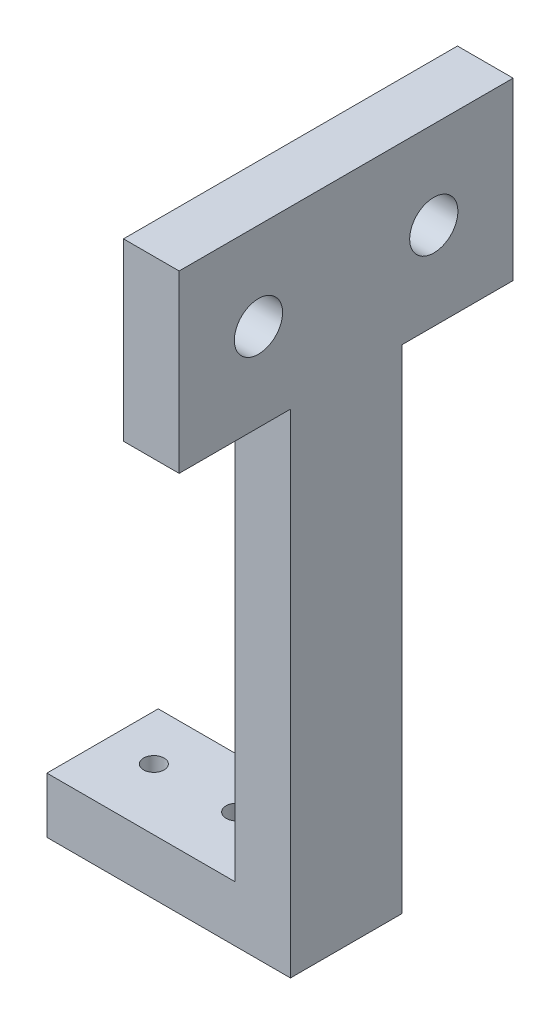
ISO-10303-21;
HEADER;
FILE_DESCRIPTION(('STEP AP214'),'2;1');
FILE_NAME('part.step','',(''),(''),'','','');
FILE_SCHEMA(('AUTOMOTIVE_DESIGN { 1 0 10303 214 1 1 1 1 }'));
ENDSEC;
DATA;
#1=APPLICATION_CONTEXT('core data for automotive mechanical design processes');
#2=APPLICATION_PROTOCOL_DEFINITION('international standard','automotive_design',2000,#1);
#3=PRODUCT_CONTEXT('',#1,'mechanical');
#4=PRODUCT('Part','Part','',(#3));
#5=PRODUCT_RELATED_PRODUCT_CATEGORY('part','',(#4));
#6=PRODUCT_DEFINITION_FORMATION('','',#4);
#7=PRODUCT_DEFINITION_CONTEXT('part definition',#1,'design');
#8=PRODUCT_DEFINITION('design','',#6,#7);
#9=PRODUCT_DEFINITION_SHAPE('','',#8);
#10=(LENGTH_UNIT() NAMED_UNIT(*) SI_UNIT(.MILLI.,.METRE.));
#11=(NAMED_UNIT(*) PLANE_ANGLE_UNIT() SI_UNIT($,.RADIAN.));
#12=(NAMED_UNIT(*) SI_UNIT($,.STERADIAN.) SOLID_ANGLE_UNIT());
#13=UNCERTAINTY_MEASURE_WITH_UNIT(LENGTH_MEASURE(1.E-05),#10,'distance_accuracy_value','');
#14=(GEOMETRIC_REPRESENTATION_CONTEXT(3) GLOBAL_UNCERTAINTY_ASSIGNED_CONTEXT((#13)) GLOBAL_UNIT_ASSIGNED_CONTEXT((#10,
#11,#12)) REPRESENTATION_CONTEXT('',''));
#15=CARTESIAN_POINT('',(0.,0.,0.));
#16=DIRECTION('',(0.,0.,1.));
#17=DIRECTION('',(1.,0.,0.));
#18=AXIS2_PLACEMENT_3D('',#15,#16,#17);
#19=CARTESIAN_POINT('',(-13.8932933364586,6.35,6.35));
#20=DIRECTION('',(1.,0.,0.));
#21=DIRECTION('',(0.,1.,0.));
#22=AXIS2_PLACEMENT_3D('',#19,#20,#21);
#23=PLANE('',#22);
#24=DIRECTION('',(0.,-1.,0.));
#25=VECTOR('',#24,1.);
#26=CARTESIAN_POINT('',(-13.8932933364586,6.35,-6.35));
#27=LINE('',#26,#25);
#28=CARTESIAN_POINT('',(-13.8932933364586,6.35,-6.35));
#29=VERTEX_POINT('',#28);
#30=CARTESIAN_POINT('',(-13.8932933364586,0.,-6.35));
#31=VERTEX_POINT('',#30);
#32=EDGE_CURVE('E153',#29,#31,#27,.T.);
#33=ORIENTED_EDGE('',*,*,#32,.T.);
#34=DIRECTION('',(0.,0.,-1.));
#35=VECTOR('',#34,1.);
#36=CARTESIAN_POINT('',(-13.8932933364586,0.,6.35));
#37=LINE('',#36,#35);
#38=CARTESIAN_POINT('',(-13.8932933364586,0.,6.35));
#39=VERTEX_POINT('',#38);
#40=EDGE_CURVE('E41',#39,#31,#37,.T.);
#41=ORIENTED_EDGE('',*,*,#40,.F.);
#42=DIRECTION('',(0.,-1.,0.));
#43=VECTOR('',#42,1.);
#44=CARTESIAN_POINT('',(-13.8932933364586,6.35,6.35));
#45=LINE('',#44,#43);
#46=CARTESIAN_POINT('',(-13.8932933364586,6.35,6.35));
#47=VERTEX_POINT('',#46);
#48=EDGE_CURVE('E154',#47,#39,#45,.T.);
#49=ORIENTED_EDGE('',*,*,#48,.F.);
#50=DIRECTION('',(0.,0.,-1.));
#51=VECTOR('',#50,1.);
#52=CARTESIAN_POINT('',(-13.8932933364586,6.35,6.35));
#53=LINE('',#52,#51);
#54=EDGE_CURVE('E165',#47,#29,#53,.T.);
#55=ORIENTED_EDGE('',*,*,#54,.T.);
#56=EDGE_LOOP('',(#33,#41,#49,#55));
#57=FACE_BOUND('',#56,.T.);
#58=ADVANCED_FACE('F34',(#57),#23,.F.);
#59=CARTESIAN_POINT('',(-13.8932933364586,0.,6.35));
#60=DIRECTION('',(0.,1.,0.));
#61=DIRECTION('',(-1.,0.,0.));
#62=AXIS2_PLACEMENT_3D('',#59,#60,#61);
#63=PLANE('',#62);
#64=CARTESIAN_POINT('',(0.806706663541388,0.,-0.649999999999986));
#65=DIRECTION('',(0.,1.,0.));
#66=DIRECTION('',(-1.,0.,0.));
#67=AXIS2_PLACEMENT_3D('',#64,#65,#66);
#68=CIRCLE('',#67,1.25);
#69=CARTESIAN_POINT('',(-0.443293336458607,0.,-0.649999999999986));
#70=VERTEX_POINT('',#69);
#71=EDGE_CURVE('E135',#70,#70,#68,.T.);
#72=ORIENTED_EDGE('',*,*,#71,.T.);
#73=EDGE_LOOP('',(#72));
#74=FACE_BOUND('',#73,.T.);
#75=CARTESIAN_POINT('',(-8.69329333645861,0.,-0.649999999999984));
#76=DIRECTION('',(0.,1.,0.));
#77=DIRECTION('',(-1.,0.,0.));
#78=AXIS2_PLACEMENT_3D('',#75,#76,#77);
#79=CIRCLE('',#78,1.175);
#80=CARTESIAN_POINT('',(-9.86829333645862,0.,-0.649999999999984));
#81=VERTEX_POINT('',#80);
#82=EDGE_CURVE('E211',#81,#81,#79,.T.);
#83=ORIENTED_EDGE('',*,*,#82,.T.);
#84=EDGE_LOOP('',(#83));
#85=FACE_BOUND('',#84,.T.);
#86=DIRECTION('',(1.,0.,0.));
#87=VECTOR('',#86,1.);
#88=CARTESIAN_POINT('',(-13.8932933364586,0.,-6.35));
#89=LINE('',#88,#87);
#90=CARTESIAN_POINT('',(13.8932933364586,0.,-6.35));
#91=VERTEX_POINT('',#90);
#92=EDGE_CURVE('E168',#31,#91,#89,.T.);
#93=ORIENTED_EDGE('',*,*,#92,.T.);
#94=DIRECTION('',(0.,0.,-1.));
#95=VECTOR('',#94,1.);
#96=CARTESIAN_POINT('',(13.8932933364586,0.,6.35));
#97=LINE('',#96,#95);
#98=CARTESIAN_POINT('',(13.8932933364586,0.,6.35));
#99=VERTEX_POINT('',#98);
#100=EDGE_CURVE('E181',#99,#91,#97,.T.);
#101=ORIENTED_EDGE('',*,*,#100,.F.);
#102=DIRECTION('',(1.,0.,0.));
#103=VECTOR('',#102,1.);
#104=CARTESIAN_POINT('',(-13.8932933364586,0.,6.35));
#105=LINE('',#104,#103);
#106=EDGE_CURVE('E157',#39,#99,#105,.T.);
#107=ORIENTED_EDGE('',*,*,#106,.F.);
#108=ORIENTED_EDGE('',*,*,#40,.T.);
#109=EDGE_LOOP('',(#93,#101,#107,#108));
#110=FACE_BOUND('',#109,.T.);
#111=ADVANCED_FACE('F186',(#74,#85,#110),#63,.F.);
#112=CARTESIAN_POINT('',(13.8932933364586,76.2,6.35));
#113=DIRECTION('',(-1.,0.,0.));
#114=DIRECTION('',(0.,-1.,0.));
#115=AXIS2_PLACEMENT_3D('',#112,#113,#114);
#116=PLANE('',#115);
#117=CARTESIAN_POINT('',(13.8932933364586,66.2,-10.));
#118=DIRECTION('',(-1.,0.,0.));
#119=DIRECTION('',(0.,-1.,0.));
#120=AXIS2_PLACEMENT_3D('',#117,#118,#119);
#121=CIRCLE('',#120,2.75);
#122=CARTESIAN_POINT('',(13.8932933364586,63.45,-10.));
#123=VERTEX_POINT('',#122);
#124=EDGE_CURVE('E212',#123,#123,#121,.T.);
#125=ORIENTED_EDGE('',*,*,#124,.T.);
#126=EDGE_LOOP('',(#125));
#127=FACE_BOUND('',#126,.T.);
#128=CARTESIAN_POINT('',(13.8932933364586,66.2,9.99999999999999));
#129=DIRECTION('',(-1.,0.,0.));
#130=DIRECTION('',(0.,-1.,0.));
#131=AXIS2_PLACEMENT_3D('',#128,#129,#130);
#132=CIRCLE('',#131,2.75);
#133=CARTESIAN_POINT('',(13.8932933364586,63.45,9.99999999999999));
#134=VERTEX_POINT('',#133);
#135=EDGE_CURVE('E220',#134,#134,#132,.T.);
#136=ORIENTED_EDGE('',*,*,#135,.T.);
#137=EDGE_LOOP('',(#136));
#138=FACE_BOUND('',#137,.T.);
#139=DIRECTION('',(0.,1.,0.));
#140=VECTOR('',#139,1.);
#141=CARTESIAN_POINT('',(13.8932933364586,76.2,-6.35));
#142=LINE('',#141,#140);
#143=CARTESIAN_POINT('',(13.8932933364586,56.2,-6.35));
#144=VERTEX_POINT('',#143);
#145=EDGE_CURVE('E170',#91,#144,#142,.T.);
#146=ORIENTED_EDGE('',*,*,#145,.T.);
#147=DIRECTION('',(0.,0.,-1.));
#148=VECTOR('',#147,1.);
#149=CARTESIAN_POINT('',(13.8932933364586,56.2,-19.05));
#150=LINE('',#149,#148);
#151=CARTESIAN_POINT('',(13.8932933364586,56.2,-19.05));
#152=VERTEX_POINT('',#151);
#153=EDGE_CURVE('E200',#144,#152,#150,.T.);
#154=ORIENTED_EDGE('',*,*,#153,.T.);
#155=DIRECTION('',(0.,1.,0.));
#156=VECTOR('',#155,1.);
#157=CARTESIAN_POINT('',(13.8932933364586,56.2,-19.05));
#158=LINE('',#157,#156);
#159=CARTESIAN_POINT('',(13.8932933364586,76.2,-19.05));
#160=VERTEX_POINT('',#159);
#161=EDGE_CURVE('E148',#152,#160,#158,.T.);
#162=ORIENTED_EDGE('',*,*,#161,.T.);
#163=DIRECTION('',(0.,0.,-1.));
#164=VECTOR('',#163,1.);
#165=CARTESIAN_POINT('',(13.8932933364586,76.2,6.35));
#166=LINE('',#165,#164);
#167=CARTESIAN_POINT('',(13.8932933364586,76.2,19.05));
#168=VERTEX_POINT('',#167);
#169=EDGE_CURVE('E118',#168,#160,#166,.T.);
#170=ORIENTED_EDGE('',*,*,#169,.F.);
#171=DIRECTION('',(0.,-1.,0.));
#172=VECTOR('',#171,1.);
#173=CARTESIAN_POINT('',(13.8932933364586,56.2,19.05));
#174=LINE('',#173,#172);
#175=CARTESIAN_POINT('',(13.8932933364586,56.2,19.05));
#176=VERTEX_POINT('',#175);
#177=EDGE_CURVE('E127',#168,#176,#174,.T.);
#178=ORIENTED_EDGE('',*,*,#177,.T.);
#179=CARTESIAN_POINT('',(13.8932933364586,56.2,6.35));
#180=VERTEX_POINT('',#179);
#181=EDGE_CURVE('E204',#176,#180,#150,.T.);
#182=ORIENTED_EDGE('',*,*,#181,.T.);
#183=DIRECTION('',(0.,1.,0.));
#184=VECTOR('',#183,1.);
#185=CARTESIAN_POINT('',(13.8932933364586,76.2,6.35));
#186=LINE('',#185,#184);
#187=EDGE_CURVE('E53',#99,#180,#186,.T.);
#188=ORIENTED_EDGE('',*,*,#187,.F.);
#189=ORIENTED_EDGE('',*,*,#100,.T.);
#190=EDGE_LOOP('',(#146,#154,#162,#170,#178,#182,#188,#189));
#191=FACE_BOUND('',#190,.T.);
#192=ADVANCED_FACE('F198',(#127,#138,#191),#116,.F.);
#193=CARTESIAN_POINT('',(13.8932933364586,76.2,6.35));
#194=DIRECTION('',(0.,-1.,0.));
#195=DIRECTION('',(0.,0.,-1.));
#196=AXIS2_PLACEMENT_3D('',#193,#194,#195);
#197=PLANE('',#196);
#198=ORIENTED_EDGE('',*,*,#169,.T.);
#199=DIRECTION('',(-1.,0.,0.));
#200=VECTOR('',#199,1.);
#201=CARTESIAN_POINT('',(56.9236314713141,76.2,-19.05));
#202=LINE('',#201,#200);
#203=CARTESIAN_POINT('',(7.5432933364586,76.2,-19.05));
#204=VERTEX_POINT('',#203);
#205=EDGE_CURVE('E113',#160,#204,#202,.T.);
#206=ORIENTED_EDGE('',*,*,#205,.T.);
#207=DIRECTION('',(0.,0.,-1.));
#208=VECTOR('',#207,1.);
#209=CARTESIAN_POINT('',(7.5432933364586,76.2,6.35));
#210=LINE('',#209,#208);
#211=CARTESIAN_POINT('',(7.5432933364586,76.2,19.05));
#212=VERTEX_POINT('',#211);
#213=EDGE_CURVE('E108',#212,#204,#210,.T.);
#214=ORIENTED_EDGE('',*,*,#213,.F.);
#215=DIRECTION('',(-1.,0.,0.));
#216=VECTOR('',#215,1.);
#217=CARTESIAN_POINT('',(56.9236314713141,76.2,19.05));
#218=LINE('',#217,#216);
#219=EDGE_CURVE('E111',#168,#212,#218,.T.);
#220=ORIENTED_EDGE('',*,*,#219,.F.);
#221=EDGE_LOOP('',(#198,#206,#214,#220));
#222=FACE_BOUND('',#221,.T.);
#223=ADVANCED_FACE('F110',(#222),#197,.F.);
#224=CARTESIAN_POINT('',(7.5432933364586,76.2,6.35));
#225=DIRECTION('',(1.,0.,0.));
#226=DIRECTION('',(0.,1.,0.));
#227=AXIS2_PLACEMENT_3D('',#224,#225,#226);
#228=PLANE('',#227);
#229=CARTESIAN_POINT('',(7.5432933364586,66.2,-10.));
#230=DIRECTION('',(-1.,0.,0.));
#231=DIRECTION('',(0.,-1.,0.));
#232=AXIS2_PLACEMENT_3D('',#229,#230,#231);
#233=CIRCLE('',#232,2.75);
#234=CARTESIAN_POINT('',(7.5432933364586,63.45,-10.));
#235=VERTEX_POINT('',#234);
#236=EDGE_CURVE('E223',#235,#235,#233,.T.);
#237=ORIENTED_EDGE('',*,*,#236,.F.);
#238=EDGE_LOOP('',(#237));
#239=FACE_BOUND('',#238,.T.);
#240=CARTESIAN_POINT('',(7.5432933364586,66.2,9.99999999999999));
#241=DIRECTION('',(-1.,0.,0.));
#242=DIRECTION('',(0.,-1.,0.));
#243=AXIS2_PLACEMENT_3D('',#240,#241,#242);
#244=CIRCLE('',#243,2.75);
#245=CARTESIAN_POINT('',(7.5432933364586,63.45,9.99999999999999));
#246=VERTEX_POINT('',#245);
#247=EDGE_CURVE('E217',#246,#246,#244,.T.);
#248=ORIENTED_EDGE('',*,*,#247,.F.);
#249=EDGE_LOOP('',(#248));
#250=FACE_BOUND('',#249,.T.);
#251=DIRECTION('',(0.,-1.,0.));
#252=VECTOR('',#251,1.);
#253=CARTESIAN_POINT('',(7.5432933364586,76.2,6.35));
#254=LINE('',#253,#252);
#255=CARTESIAN_POINT('',(7.5432933364586,56.2,6.35));
#256=VERTEX_POINT('',#255);
#257=CARTESIAN_POINT('',(7.54329333645861,6.35,6.35));
#258=VERTEX_POINT('',#257);
#259=EDGE_CURVE('E161',#256,#258,#254,.T.);
#260=ORIENTED_EDGE('',*,*,#259,.F.);
#261=DIRECTION('',(0.,0.,1.));
#262=VECTOR('',#261,1.);
#263=CARTESIAN_POINT('',(7.5432933364586,56.2,-19.05));
#264=LINE('',#263,#262);
#265=CARTESIAN_POINT('',(7.5432933364586,56.2,19.05));
#266=VERTEX_POINT('',#265);
#267=EDGE_CURVE('E132',#256,#266,#264,.T.);
#268=ORIENTED_EDGE('',*,*,#267,.T.);
#269=DIRECTION('',(0.,1.,0.));
#270=VECTOR('',#269,1.);
#271=CARTESIAN_POINT('',(7.5432933364586,56.2,19.05));
#272=LINE('',#271,#270);
#273=EDGE_CURVE('E126',#266,#212,#272,.T.);
#274=ORIENTED_EDGE('',*,*,#273,.T.);
#275=ORIENTED_EDGE('',*,*,#213,.T.);
#276=DIRECTION('',(0.,-1.,0.));
#277=VECTOR('',#276,1.);
#278=CARTESIAN_POINT('',(7.5432933364586,56.2,-19.05));
#279=LINE('',#278,#277);
#280=CARTESIAN_POINT('',(7.5432933364586,56.2,-19.05));
#281=VERTEX_POINT('',#280);
#282=EDGE_CURVE('E134',#204,#281,#279,.T.);
#283=ORIENTED_EDGE('',*,*,#282,.T.);
#284=CARTESIAN_POINT('',(7.5432933364586,56.2,-6.35));
#285=VERTEX_POINT('',#284);
#286=EDGE_CURVE('E128',#281,#285,#264,.T.);
#287=ORIENTED_EDGE('',*,*,#286,.T.);
#288=DIRECTION('',(0.,-1.,0.));
#289=VECTOR('',#288,1.);
#290=CARTESIAN_POINT('',(7.5432933364586,76.2,-6.35));
#291=LINE('',#290,#289);
#292=CARTESIAN_POINT('',(7.54329333645861,6.35,-6.35));
#293=VERTEX_POINT('',#292);
#294=EDGE_CURVE('E173',#285,#293,#291,.T.);
#295=ORIENTED_EDGE('',*,*,#294,.T.);
#296=DIRECTION('',(0.,0.,-1.));
#297=VECTOR('',#296,1.);
#298=CARTESIAN_POINT('',(7.54329333645861,6.35,6.35));
#299=LINE('',#298,#297);
#300=EDGE_CURVE('E119',#258,#293,#299,.T.);
#301=ORIENTED_EDGE('',*,*,#300,.F.);
#302=EDGE_LOOP('',(#260,#268,#274,#275,#283,#287,#295,#301));
#303=FACE_BOUND('',#302,.T.);
#304=ADVANCED_FACE('F130',(#239,#250,#303),#228,.F.);
#305=CARTESIAN_POINT('',(7.54329333645861,6.35,6.35));
#306=DIRECTION('',(0.,-1.,0.));
#307=DIRECTION('',(1.,0.,0.));
#308=AXIS2_PLACEMENT_3D('',#305,#306,#307);
#309=PLANE('',#308);
#310=CARTESIAN_POINT('',(0.806706663541387,6.35,-0.649999999999986));
#311=DIRECTION('',(0.,1.,0.));
#312=DIRECTION('',(-1.,0.,0.));
#313=AXIS2_PLACEMENT_3D('',#310,#311,#312);
#314=CIRCLE('',#313,1.25);
#315=CARTESIAN_POINT('',(-0.443293336458608,6.35,-0.649999999999986));
#316=VERTEX_POINT('',#315);
#317=EDGE_CURVE('E139',#316,#316,#314,.T.);
#318=ORIENTED_EDGE('',*,*,#317,.F.);
#319=EDGE_LOOP('',(#318));
#320=FACE_BOUND('',#319,.T.);
#321=CARTESIAN_POINT('',(-8.69329333645861,6.35,-0.649999999999984));
#322=DIRECTION('',(0.,1.,0.));
#323=DIRECTION('',(-1.,0.,0.));
#324=AXIS2_PLACEMENT_3D('',#321,#322,#323);
#325=CIRCLE('',#324,1.175);
#326=CARTESIAN_POINT('',(-9.86829333645862,6.35,-0.649999999999984));
#327=VERTEX_POINT('',#326);
#328=EDGE_CURVE('E208',#327,#327,#325,.T.);
#329=ORIENTED_EDGE('',*,*,#328,.F.);
#330=EDGE_LOOP('',(#329));
#331=FACE_BOUND('',#330,.T.);
#332=DIRECTION('',(-1.,0.,0.));
#333=VECTOR('',#332,1.);
#334=CARTESIAN_POINT('',(7.54329333645861,6.35,-6.35));
#335=LINE('',#334,#333);
#336=EDGE_CURVE('E158',#293,#29,#335,.T.);
#337=ORIENTED_EDGE('',*,*,#336,.T.);
#338=ORIENTED_EDGE('',*,*,#54,.F.);
#339=DIRECTION('',(-1.,0.,0.));
#340=VECTOR('',#339,1.);
#341=CARTESIAN_POINT('',(7.54329333645861,6.35,6.35));
#342=LINE('',#341,#340);
#343=EDGE_CURVE('E163',#258,#47,#342,.T.);
#344=ORIENTED_EDGE('',*,*,#343,.F.);
#345=ORIENTED_EDGE('',*,*,#300,.T.);
#346=EDGE_LOOP('',(#337,#338,#344,#345));
#347=FACE_BOUND('',#346,.T.);
#348=ADVANCED_FACE('F240',(#320,#331,#347),#309,.F.);
#349=CARTESIAN_POINT('',(0.,0.,6.35));
#350=DIRECTION('',(0.,0.,1.));
#351=DIRECTION('',(1.,0.,0.));
#352=AXIS2_PLACEMENT_3D('',#349,#350,#351);
#353=PLANE('',#352);
#354=DIRECTION('',(1.,0.,0.));
#355=VECTOR('',#354,1.);
#356=CARTESIAN_POINT('',(0.,56.2,6.35));
#357=LINE('',#356,#355);
#358=EDGE_CURVE('E48',#256,#180,#357,.T.);
#359=ORIENTED_EDGE('',*,*,#358,.F.);
#360=ORIENTED_EDGE('',*,*,#259,.T.);
#361=ORIENTED_EDGE('',*,*,#343,.T.);
#362=ORIENTED_EDGE('',*,*,#48,.T.);
#363=ORIENTED_EDGE('',*,*,#106,.T.);
#364=ORIENTED_EDGE('',*,*,#187,.T.);
#365=EDGE_LOOP('',(#359,#360,#361,#362,#363,#364));
#366=FACE_BOUND('',#365,.T.);
#367=ADVANCED_FACE('F270',(#366),#353,.T.);
#368=CARTESIAN_POINT('',(0.,0.,-6.35));
#369=DIRECTION('',(0.,0.,1.));
#370=DIRECTION('',(1.,0.,0.));
#371=AXIS2_PLACEMENT_3D('',#368,#369,#370);
#372=PLANE('',#371);
#373=ORIENTED_EDGE('',*,*,#294,.F.);
#374=DIRECTION('',(1.,0.,0.));
#375=VECTOR('',#374,1.);
#376=CARTESIAN_POINT('',(0.,56.2,-6.35));
#377=LINE('',#376,#375);
#378=EDGE_CURVE('E11',#285,#144,#377,.T.);
#379=ORIENTED_EDGE('',*,*,#378,.T.);
#380=ORIENTED_EDGE('',*,*,#145,.F.);
#381=ORIENTED_EDGE('',*,*,#92,.F.);
#382=ORIENTED_EDGE('',*,*,#32,.F.);
#383=ORIENTED_EDGE('',*,*,#336,.F.);
#384=EDGE_LOOP('',(#373,#379,#380,#381,#382,#383));
#385=FACE_BOUND('',#384,.T.);
#386=ADVANCED_FACE('F195',(#385),#372,.F.);
#387=CARTESIAN_POINT('',(56.9236314713141,56.2,-19.05));
#388=DIRECTION('',(0.,0.,-1.));
#389=DIRECTION('',(-1.,0.,0.));
#390=AXIS2_PLACEMENT_3D('',#387,#388,#389);
#391=PLANE('',#390);
#392=ORIENTED_EDGE('',*,*,#161,.F.);
#393=DIRECTION('',(-1.,0.,0.));
#394=VECTOR('',#393,1.);
#395=CARTESIAN_POINT('',(56.9236314713141,56.2,-19.05));
#396=LINE('',#395,#394);
#397=EDGE_CURVE('E149',#152,#281,#396,.T.);
#398=ORIENTED_EDGE('',*,*,#397,.T.);
#399=ORIENTED_EDGE('',*,*,#282,.F.);
#400=ORIENTED_EDGE('',*,*,#205,.F.);
#401=EDGE_LOOP('',(#392,#398,#399,#400));
#402=FACE_BOUND('',#401,.T.);
#403=ADVANCED_FACE('F274',(#402),#391,.T.);
#404=CARTESIAN_POINT('',(56.9236314713141,56.2,-19.05));
#405=DIRECTION('',(0.,-1.,0.));
#406=DIRECTION('',(0.,0.,-1.));
#407=AXIS2_PLACEMENT_3D('',#404,#405,#406);
#408=PLANE('',#407);
#409=ORIENTED_EDGE('',*,*,#378,.F.);
#410=ORIENTED_EDGE('',*,*,#286,.F.);
#411=ORIENTED_EDGE('',*,*,#397,.F.);
#412=ORIENTED_EDGE('',*,*,#153,.F.);
#413=EDGE_LOOP('',(#409,#410,#411,#412));
#414=FACE_BOUND('',#413,.T.);
#415=ADVANCED_FACE('F280',(#414),#408,.T.);
#416=CARTESIAN_POINT('',(56.9236314713141,56.2,19.05));
#417=DIRECTION('',(0.,0.,1.));
#418=DIRECTION('',(0.,-1.,0.));
#419=AXIS2_PLACEMENT_3D('',#416,#417,#418);
#420=PLANE('',#419);
#421=ORIENTED_EDGE('',*,*,#177,.F.);
#422=ORIENTED_EDGE('',*,*,#219,.T.);
#423=ORIENTED_EDGE('',*,*,#273,.F.);
#424=DIRECTION('',(-1.,0.,0.));
#425=VECTOR('',#424,1.);
#426=CARTESIAN_POINT('',(56.9236314713141,56.2,19.05));
#427=LINE('',#426,#425);
#428=EDGE_CURVE('E146',#176,#266,#427,.T.);
#429=ORIENTED_EDGE('',*,*,#428,.F.);
#430=EDGE_LOOP('',(#421,#422,#423,#429));
#431=FACE_BOUND('',#430,.T.);
#432=ADVANCED_FACE('F124',(#431),#420,.T.);
#433=ORIENTED_EDGE('',*,*,#267,.F.);
#434=ORIENTED_EDGE('',*,*,#358,.T.);
#435=ORIENTED_EDGE('',*,*,#181,.F.);
#436=ORIENTED_EDGE('',*,*,#428,.T.);
#437=EDGE_LOOP('',(#433,#434,#435,#436));
#438=FACE_BOUND('',#437,.T.);
#439=ADVANCED_FACE('F279',(#438),#408,.T.);
#440=CARTESIAN_POINT('',(-8.69329333645861,0.,-0.649999999999984));
#441=DIRECTION('',(0.,1.,0.));
#442=DIRECTION('',(-1.,0.,0.));
#443=AXIS2_PLACEMENT_3D('',#440,#441,#442);
#444=CYLINDRICAL_SURFACE('',#443,1.175);
#445=ORIENTED_EDGE('',*,*,#82,.F.);
#446=EDGE_LOOP('',(#445));
#447=FACE_BOUND('',#446,.T.);
#448=ORIENTED_EDGE('',*,*,#328,.T.);
#449=EDGE_LOOP('',(#448));
#450=FACE_BOUND('',#449,.T.);
#451=ADVANCED_FACE('F251',(#447,#450),#444,.F.);
#452=CARTESIAN_POINT('',(0.806706663541388,0.,-0.649999999999986));
#453=DIRECTION('',(0.,1.,0.));
#454=DIRECTION('',(-1.,0.,0.));
#455=AXIS2_PLACEMENT_3D('',#452,#453,#454);
#456=CYLINDRICAL_SURFACE('',#455,1.25);
#457=ORIENTED_EDGE('',*,*,#71,.F.);
#458=EDGE_LOOP('',(#457));
#459=FACE_BOUND('',#458,.T.);
#460=ORIENTED_EDGE('',*,*,#317,.T.);
#461=EDGE_LOOP('',(#460));
#462=FACE_BOUND('',#461,.T.);
#463=ADVANCED_FACE('F245',(#459,#462),#456,.F.);
#464=CARTESIAN_POINT('',(13.8932933364586,66.2,9.99999999999999));
#465=DIRECTION('',(-1.,0.,0.));
#466=DIRECTION('',(0.,-1.,0.));
#467=AXIS2_PLACEMENT_3D('',#464,#465,#466);
#468=CYLINDRICAL_SURFACE('',#467,2.75);
#469=ORIENTED_EDGE('',*,*,#135,.F.);
#470=EDGE_LOOP('',(#469));
#471=FACE_BOUND('',#470,.T.);
#472=ORIENTED_EDGE('',*,*,#247,.T.);
#473=EDGE_LOOP('',(#472));
#474=FACE_BOUND('',#473,.T.);
#475=ADVANCED_FACE('F234',(#471,#474),#468,.F.);
#476=CARTESIAN_POINT('',(13.8932933364586,66.2,-10.));
#477=DIRECTION('',(-1.,0.,0.));
#478=DIRECTION('',(0.,-1.,0.));
#479=AXIS2_PLACEMENT_3D('',#476,#477,#478);
#480=CYLINDRICAL_SURFACE('',#479,2.75);
#481=ORIENTED_EDGE('',*,*,#124,.F.);
#482=EDGE_LOOP('',(#481));
#483=FACE_BOUND('',#482,.T.);
#484=ORIENTED_EDGE('',*,*,#236,.T.);
#485=EDGE_LOOP('',(#484));
#486=FACE_BOUND('',#485,.T.);
#487=ADVANCED_FACE('F231',(#483,#486),#480,.F.);
#488=CLOSED_SHELL('',(#58,#111,#192,#223,#304,#348,#367,#386,#403,#415,#432,#439,#451,#463,#475,#487));
#489=MANIFOLD_SOLID_BREP('B2',#488);
#490=ADVANCED_BREP_SHAPE_REPRESENTATION('',(#18,#489),#14);
#491=SHAPE_DEFINITION_REPRESENTATION(#9,#490);
ENDSEC;
END-ISO-10303-21;
